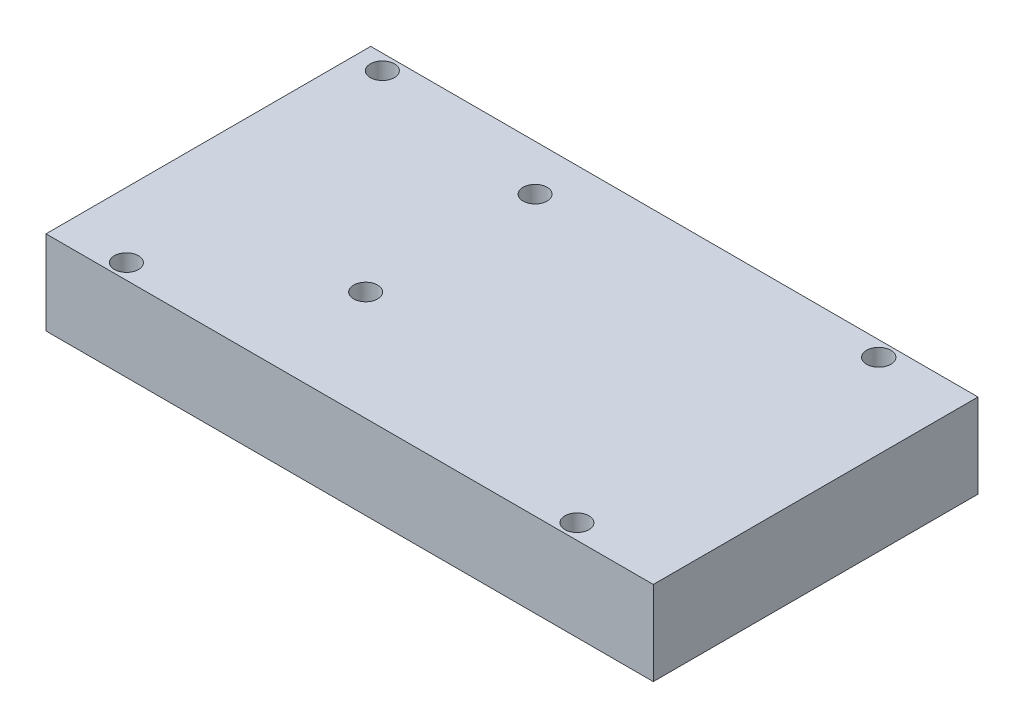
ISO-10303-21;
HEADER;
FILE_DESCRIPTION(('STEP AP214'),'2;1');
FILE_NAME('part.step','',(''),(''),'','','');
FILE_SCHEMA(('AUTOMOTIVE_DESIGN { 1 0 10303 214 1 1 1 1 }'));
ENDSEC;
DATA;
#1=APPLICATION_CONTEXT('core data for automotive mechanical design processes');
#2=APPLICATION_PROTOCOL_DEFINITION('international standard','automotive_design',2000,#1);
#3=PRODUCT_CONTEXT('',#1,'mechanical');
#4=PRODUCT('Part','Part','',(#3));
#5=PRODUCT_RELATED_PRODUCT_CATEGORY('part','',(#4));
#6=PRODUCT_DEFINITION_FORMATION('','',#4);
#7=PRODUCT_DEFINITION_CONTEXT('part definition',#1,'design');
#8=PRODUCT_DEFINITION('design','',#6,#7);
#9=PRODUCT_DEFINITION_SHAPE('','',#8);
#10=(LENGTH_UNIT() NAMED_UNIT(*) SI_UNIT(.MILLI.,.METRE.));
#11=(NAMED_UNIT(*) PLANE_ANGLE_UNIT() SI_UNIT($,.RADIAN.));
#12=(NAMED_UNIT(*) SI_UNIT($,.STERADIAN.) SOLID_ANGLE_UNIT());
#13=UNCERTAINTY_MEASURE_WITH_UNIT(LENGTH_MEASURE(1.E-05),#10,'distance_accuracy_value','');
#14=(GEOMETRIC_REPRESENTATION_CONTEXT(3) GLOBAL_UNCERTAINTY_ASSIGNED_CONTEXT((#13)) GLOBAL_UNIT_ASSIGNED_CONTEXT((#10,
#11,#12)) REPRESENTATION_CONTEXT('',''));
#15=CARTESIAN_POINT('',(0.,0.,0.));
#16=DIRECTION('',(0.,0.,1.));
#17=DIRECTION('',(1.,0.,0.));
#18=AXIS2_PLACEMENT_3D('',#15,#16,#17);
#19=CARTESIAN_POINT('',(50.5,14.,27.));
#20=DIRECTION('',(-1.,0.,0.));
#21=DIRECTION('',(0.,0.,1.));
#22=AXIS2_PLACEMENT_3D('',#19,#20,#21);
#23=PLANE('',#22);
#24=DIRECTION('',(0.,0.,-1.));
#25=VECTOR('',#24,1.);
#26=CARTESIAN_POINT('',(50.5,0.,27.));
#27=LINE('',#26,#25);
#28=CARTESIAN_POINT('',(50.5,0.,27.));
#29=VERTEX_POINT('',#28);
#30=CARTESIAN_POINT('',(50.5,0.,-27.));
#31=VERTEX_POINT('',#30);
#32=EDGE_CURVE('E116',#29,#31,#27,.T.);
#33=ORIENTED_EDGE('',*,*,#32,.T.);
#34=DIRECTION('',(0.,-1.,0.));
#35=VECTOR('',#34,1.);
#36=CARTESIAN_POINT('',(50.5,14.,-27.));
#37=LINE('',#36,#35);
#38=CARTESIAN_POINT('',(50.5,14.,-27.));
#39=VERTEX_POINT('',#38);
#40=EDGE_CURVE('E11',#39,#31,#37,.T.);
#41=ORIENTED_EDGE('',*,*,#40,.F.);
#42=DIRECTION('',(0.,0.,-1.));
#43=VECTOR('',#42,1.);
#44=CARTESIAN_POINT('',(50.5,14.,27.));
#45=LINE('',#44,#43);
#46=CARTESIAN_POINT('',(50.5,14.,27.));
#47=VERTEX_POINT('',#46);
#48=EDGE_CURVE('E99',#47,#39,#45,.T.);
#49=ORIENTED_EDGE('',*,*,#48,.F.);
#50=DIRECTION('',(0.,-1.,0.));
#51=VECTOR('',#50,1.);
#52=CARTESIAN_POINT('',(50.5,14.,27.));
#53=LINE('',#52,#51);
#54=EDGE_CURVE('E112',#47,#29,#53,.T.);
#55=ORIENTED_EDGE('',*,*,#54,.T.);
#56=EDGE_LOOP('',(#33,#41,#49,#55));
#57=FACE_BOUND('',#56,.T.);
#58=ADVANCED_FACE('F45',(#57),#23,.F.);
#59=CARTESIAN_POINT('',(-50.5,14.,-27.));
#60=DIRECTION('',(0.,0.,1.));
#61=DIRECTION('',(1.,0.,0.));
#62=AXIS2_PLACEMENT_3D('',#59,#60,#61);
#63=PLANE('',#62);
#64=DIRECTION('',(-1.,0.,0.));
#65=VECTOR('',#64,1.);
#66=CARTESIAN_POINT('',(-50.5,0.,-27.));
#67=LINE('',#66,#65);
#68=CARTESIAN_POINT('',(-50.5,0.,-27.));
#69=VERTEX_POINT('',#68);
#70=EDGE_CURVE('E104',#31,#69,#67,.T.);
#71=ORIENTED_EDGE('',*,*,#70,.T.);
#72=DIRECTION('',(0.,-1.,0.));
#73=VECTOR('',#72,1.);
#74=CARTESIAN_POINT('',(-50.5,14.,-27.));
#75=LINE('',#74,#73);
#76=CARTESIAN_POINT('',(-50.5,14.,-27.));
#77=VERTEX_POINT('',#76);
#78=EDGE_CURVE('E55',#77,#69,#75,.T.);
#79=ORIENTED_EDGE('',*,*,#78,.F.);
#80=DIRECTION('',(-1.,0.,0.));
#81=VECTOR('',#80,1.);
#82=CARTESIAN_POINT('',(-50.5,14.,-27.));
#83=LINE('',#82,#81);
#84=EDGE_CURVE('E94',#39,#77,#83,.T.);
#85=ORIENTED_EDGE('',*,*,#84,.F.);
#86=ORIENTED_EDGE('',*,*,#40,.T.);
#87=EDGE_LOOP('',(#71,#79,#85,#86));
#88=FACE_BOUND('',#87,.T.);
#89=ADVANCED_FACE('F103',(#88),#63,.F.);
#90=CARTESIAN_POINT('',(-50.5,14.,27.));
#91=DIRECTION('',(1.,0.,0.));
#92=DIRECTION('',(0.,0.,-1.));
#93=AXIS2_PLACEMENT_3D('',#90,#91,#92);
#94=PLANE('',#93);
#95=DIRECTION('',(0.,0.,1.));
#96=VECTOR('',#95,1.);
#97=CARTESIAN_POINT('',(-50.5,0.,27.));
#98=LINE('',#97,#96);
#99=CARTESIAN_POINT('',(-50.5,0.,27.));
#100=VERTEX_POINT('',#99);
#101=EDGE_CURVE('E81',#69,#100,#98,.T.);
#102=ORIENTED_EDGE('',*,*,#101,.T.);
#103=DIRECTION('',(0.,-1.,0.));
#104=VECTOR('',#103,1.);
#105=CARTESIAN_POINT('',(-50.5,14.,27.));
#106=LINE('',#105,#104);
#107=CARTESIAN_POINT('',(-50.5,14.,27.));
#108=VERTEX_POINT('',#107);
#109=EDGE_CURVE('E106',#108,#100,#106,.T.);
#110=ORIENTED_EDGE('',*,*,#109,.F.);
#111=DIRECTION('',(0.,0.,1.));
#112=VECTOR('',#111,1.);
#113=CARTESIAN_POINT('',(-50.5,14.,27.));
#114=LINE('',#113,#112);
#115=EDGE_CURVE('E97',#77,#108,#114,.T.);
#116=ORIENTED_EDGE('',*,*,#115,.F.);
#117=ORIENTED_EDGE('',*,*,#78,.T.);
#118=EDGE_LOOP('',(#102,#110,#116,#117));
#119=FACE_BOUND('',#118,.T.);
#120=ADVANCED_FACE('F108',(#119),#94,.F.);
#121=CARTESIAN_POINT('',(-50.5,14.,27.));
#122=DIRECTION('',(0.,0.,-1.));
#123=DIRECTION('',(-1.,0.,0.));
#124=AXIS2_PLACEMENT_3D('',#121,#122,#123);
#125=PLANE('',#124);
#126=DIRECTION('',(1.,0.,0.));
#127=VECTOR('',#126,1.);
#128=CARTESIAN_POINT('',(-50.5,0.,27.));
#129=LINE('',#128,#127);
#130=EDGE_CURVE('E87',#100,#29,#129,.T.);
#131=ORIENTED_EDGE('',*,*,#130,.T.);
#132=ORIENTED_EDGE('',*,*,#54,.F.);
#133=DIRECTION('',(1.,0.,0.));
#134=VECTOR('',#133,1.);
#135=CARTESIAN_POINT('',(-50.5,14.,27.));
#136=LINE('',#135,#134);
#137=EDGE_CURVE('E64',#108,#47,#136,.T.);
#138=ORIENTED_EDGE('',*,*,#137,.F.);
#139=ORIENTED_EDGE('',*,*,#109,.T.);
#140=EDGE_LOOP('',(#131,#132,#138,#139));
#141=FACE_BOUND('',#140,.T.);
#142=ADVANCED_FACE('F174',(#141),#125,.F.);
#143=CARTESIAN_POINT('',(0.,14.,0.));
#144=DIRECTION('',(0.,-1.,0.));
#145=DIRECTION('',(0.,0.,-1.));
#146=AXIS2_PLACEMENT_3D('',#143,#144,#145);
#147=PLANE('',#146);
#148=CARTESIAN_POINT('',(-46.02,14.,-24.46));
#149=DIRECTION('',(0.,1.,0.));
#150=DIRECTION('',(0.,0.,1.));
#151=AXIS2_PLACEMENT_3D('',#148,#149,#150);
#152=CIRCLE('',#151,2.);
#153=CARTESIAN_POINT('',(-46.02,14.,-22.46));
#154=VERTEX_POINT('',#153);
#155=EDGE_CURVE('E135',#154,#154,#152,.T.);
#156=ORIENTED_EDGE('',*,*,#155,.F.);
#157=EDGE_LOOP('',(#156));
#158=FACE_BOUND('',#157,.T.);
#159=CARTESIAN_POINT('',(-15.54,14.,-19.38));
#160=DIRECTION('',(0.,1.,0.));
#161=DIRECTION('',(0.,0.,1.));
#162=AXIS2_PLACEMENT_3D('',#159,#160,#161);
#163=CIRCLE('',#162,2.);
#164=CARTESIAN_POINT('',(-15.54,14.,-17.38));
#165=VERTEX_POINT('',#164);
#166=EDGE_CURVE('E274',#165,#165,#163,.T.);
#167=ORIENTED_EDGE('',*,*,#166,.F.);
#168=EDGE_LOOP('',(#167));
#169=FACE_BOUND('',#168,.T.);
#170=CARTESIAN_POINT('',(-39.67,14.,24.46));
#171=DIRECTION('',(0.,1.,0.));
#172=DIRECTION('',(0.,0.,1.));
#173=AXIS2_PLACEMENT_3D('',#170,#171,#172);
#174=CIRCLE('',#173,2.);
#175=CARTESIAN_POINT('',(-39.67,14.,26.46));
#176=VERTEX_POINT('',#175);
#177=EDGE_CURVE('E289',#176,#176,#174,.T.);
#178=ORIENTED_EDGE('',*,*,#177,.F.);
#179=EDGE_LOOP('',(#178));
#180=FACE_BOUND('',#179,.T.);
#181=CARTESIAN_POINT('',(36.53,14.,-24.46));
#182=DIRECTION('',(0.,1.,0.));
#183=DIRECTION('',(0.,0.,1.));
#184=AXIS2_PLACEMENT_3D('',#181,#182,#183);
#185=CIRCLE('',#184,2.02327688758629);
#186=CARTESIAN_POINT('',(36.53,14.,-22.4367231124137));
#187=VERTEX_POINT('',#186);
#188=EDGE_CURVE('E287',#187,#187,#185,.T.);
#189=ORIENTED_EDGE('',*,*,#188,.F.);
#190=EDGE_LOOP('',(#189));
#191=FACE_BOUND('',#190,.T.);
#192=CARTESIAN_POINT('',(-15.54,14.,8.79890287068528));
#193=DIRECTION('',(0.,1.,0.));
#194=DIRECTION('',(0.,0.,1.));
#195=AXIS2_PLACEMENT_3D('',#192,#193,#194);
#196=CIRCLE('',#195,2.);
#197=CARTESIAN_POINT('',(-15.54,14.,10.7989028706853));
#198=VERTEX_POINT('',#197);
#199=EDGE_CURVE('E281',#198,#198,#196,.T.);
#200=ORIENTED_EDGE('',*,*,#199,.F.);
#201=EDGE_LOOP('',(#200));
#202=FACE_BOUND('',#201,.T.);
#203=CARTESIAN_POINT('',(35.26,14.,24.46));
#204=DIRECTION('',(0.,1.,0.));
#205=DIRECTION('',(0.,0.,1.));
#206=AXIS2_PLACEMENT_3D('',#203,#204,#205);
#207=CIRCLE('',#206,2.);
#208=CARTESIAN_POINT('',(35.26,14.,26.46));
#209=VERTEX_POINT('',#208);
#210=EDGE_CURVE('E277',#209,#209,#207,.T.);
#211=ORIENTED_EDGE('',*,*,#210,.F.);
#212=EDGE_LOOP('',(#211));
#213=FACE_BOUND('',#212,.T.);
#214=ORIENTED_EDGE('',*,*,#48,.T.);
#215=ORIENTED_EDGE('',*,*,#84,.T.);
#216=ORIENTED_EDGE('',*,*,#115,.T.);
#217=ORIENTED_EDGE('',*,*,#137,.T.);
#218=EDGE_LOOP('',(#214,#215,#216,#217));
#219=FACE_BOUND('',#218,.T.);
#220=ADVANCED_FACE('F95',(#158,#169,#180,#191,#202,#213,#219),#147,.F.);
#221=CARTESIAN_POINT('',(0.,0.,0.));
#222=DIRECTION('',(0.,-1.,0.));
#223=DIRECTION('',(0.,0.,-1.));
#224=AXIS2_PLACEMENT_3D('',#221,#222,#223);
#225=PLANE('',#224);
#226=CARTESIAN_POINT('',(-46.02,0.,-24.46));
#227=DIRECTION('',(0.,-1.,0.));
#228=DIRECTION('',(0.,0.,-1.));
#229=AXIS2_PLACEMENT_3D('',#226,#227,#228);
#230=CIRCLE('',#229,2.);
#231=CARTESIAN_POINT('',(-46.02,0.,-26.46));
#232=VERTEX_POINT('',#231);
#233=EDGE_CURVE('E48',#232,#232,#230,.T.);
#234=ORIENTED_EDGE('',*,*,#233,.F.);
#235=EDGE_LOOP('',(#234));
#236=FACE_BOUND('',#235,.T.);
#237=CARTESIAN_POINT('',(-15.54,0.,-19.38));
#238=DIRECTION('',(0.,-1.,0.));
#239=DIRECTION('',(0.,0.,-1.));
#240=AXIS2_PLACEMENT_3D('',#237,#238,#239);
#241=CIRCLE('',#240,2.);
#242=CARTESIAN_POINT('',(-15.54,0.,-21.38));
#243=VERTEX_POINT('',#242);
#244=EDGE_CURVE('E146',#243,#243,#241,.T.);
#245=ORIENTED_EDGE('',*,*,#244,.F.);
#246=EDGE_LOOP('',(#245));
#247=FACE_BOUND('',#246,.T.);
#248=CARTESIAN_POINT('',(-39.67,0.,24.46));
#249=DIRECTION('',(0.,-1.,0.));
#250=DIRECTION('',(0.,0.,-1.));
#251=AXIS2_PLACEMENT_3D('',#248,#249,#250);
#252=CIRCLE('',#251,2.);
#253=CARTESIAN_POINT('',(-39.67,0.,22.46));
#254=VERTEX_POINT('',#253);
#255=EDGE_CURVE('E143',#254,#254,#252,.T.);
#256=ORIENTED_EDGE('',*,*,#255,.F.);
#257=EDGE_LOOP('',(#256));
#258=FACE_BOUND('',#257,.T.);
#259=CARTESIAN_POINT('',(36.53,0.,-24.46));
#260=DIRECTION('',(0.,-1.,0.));
#261=DIRECTION('',(0.,0.,-1.));
#262=AXIS2_PLACEMENT_3D('',#259,#260,#261);
#263=CIRCLE('',#262,2.02327688758629);
#264=CARTESIAN_POINT('',(36.53,0.,-26.4832768875863));
#265=VERTEX_POINT('',#264);
#266=EDGE_CURVE('E139',#265,#265,#263,.T.);
#267=ORIENTED_EDGE('',*,*,#266,.F.);
#268=EDGE_LOOP('',(#267));
#269=FACE_BOUND('',#268,.T.);
#270=CARTESIAN_POINT('',(-15.54,0.,8.79890287068528));
#271=DIRECTION('',(0.,-1.,0.));
#272=DIRECTION('',(0.,0.,-1.));
#273=AXIS2_PLACEMENT_3D('',#270,#271,#272);
#274=CIRCLE('',#273,2.);
#275=CARTESIAN_POINT('',(-15.54,0.,6.79890287068528));
#276=VERTEX_POINT('',#275);
#277=EDGE_CURVE('E134',#276,#276,#274,.T.);
#278=ORIENTED_EDGE('',*,*,#277,.F.);
#279=EDGE_LOOP('',(#278));
#280=FACE_BOUND('',#279,.T.);
#281=CARTESIAN_POINT('',(35.26,0.,24.46));
#282=DIRECTION('',(0.,-1.,0.));
#283=DIRECTION('',(0.,0.,-1.));
#284=AXIS2_PLACEMENT_3D('',#281,#282,#283);
#285=CIRCLE('',#284,2.);
#286=CARTESIAN_POINT('',(35.26,0.,22.46));
#287=VERTEX_POINT('',#286);
#288=EDGE_CURVE('E130',#287,#287,#285,.T.);
#289=ORIENTED_EDGE('',*,*,#288,.F.);
#290=EDGE_LOOP('',(#289));
#291=FACE_BOUND('',#290,.T.);
#292=ORIENTED_EDGE('',*,*,#32,.F.);
#293=ORIENTED_EDGE('',*,*,#130,.F.);
#294=ORIENTED_EDGE('',*,*,#101,.F.);
#295=ORIENTED_EDGE('',*,*,#70,.F.);
#296=EDGE_LOOP('',(#292,#293,#294,#295));
#297=FACE_BOUND('',#296,.T.);
#298=ADVANCED_FACE('F158',(#236,#247,#258,#269,#280,#291,#297),#225,.T.);
#299=CARTESIAN_POINT('',(35.26,-86.,24.46));
#300=DIRECTION('',(0.,1.,0.));
#301=DIRECTION('',(0.,0.,1.));
#302=AXIS2_PLACEMENT_3D('',#299,#300,#301);
#303=CYLINDRICAL_SURFACE('',#302,2.);
#304=ORIENTED_EDGE('',*,*,#288,.T.);
#305=EDGE_LOOP('',(#304));
#306=FACE_BOUND('',#305,.T.);
#307=ORIENTED_EDGE('',*,*,#210,.T.);
#308=EDGE_LOOP('',(#307));
#309=FACE_BOUND('',#308,.T.);
#310=ADVANCED_FACE('F161',(#306,#309),#303,.F.);
#311=CARTESIAN_POINT('',(-15.54,-86.,8.79890287068528));
#312=DIRECTION('',(0.,1.,0.));
#313=DIRECTION('',(0.,0.,1.));
#314=AXIS2_PLACEMENT_3D('',#311,#312,#313);
#315=CYLINDRICAL_SURFACE('',#314,2.);
#316=ORIENTED_EDGE('',*,*,#277,.T.);
#317=EDGE_LOOP('',(#316));
#318=FACE_BOUND('',#317,.T.);
#319=ORIENTED_EDGE('',*,*,#199,.T.);
#320=EDGE_LOOP('',(#319));
#321=FACE_BOUND('',#320,.T.);
#322=ADVANCED_FACE('F221',(#318,#321),#315,.F.);
#323=CARTESIAN_POINT('',(36.53,-86.,-24.46));
#324=DIRECTION('',(0.,1.,0.));
#325=DIRECTION('',(0.,0.,1.));
#326=AXIS2_PLACEMENT_3D('',#323,#324,#325);
#327=CYLINDRICAL_SURFACE('',#326,2.02327688758629);
#328=ORIENTED_EDGE('',*,*,#266,.T.);
#329=EDGE_LOOP('',(#328));
#330=FACE_BOUND('',#329,.T.);
#331=ORIENTED_EDGE('',*,*,#188,.T.);
#332=EDGE_LOOP('',(#331));
#333=FACE_BOUND('',#332,.T.);
#334=ADVANCED_FACE('F231',(#330,#333),#327,.F.);
#335=CARTESIAN_POINT('',(-39.67,-86.,24.46));
#336=DIRECTION('',(0.,1.,0.));
#337=DIRECTION('',(0.,0.,1.));
#338=AXIS2_PLACEMENT_3D('',#335,#336,#337);
#339=CYLINDRICAL_SURFACE('',#338,2.);
#340=ORIENTED_EDGE('',*,*,#255,.T.);
#341=EDGE_LOOP('',(#340));
#342=FACE_BOUND('',#341,.T.);
#343=ORIENTED_EDGE('',*,*,#177,.T.);
#344=EDGE_LOOP('',(#343));
#345=FACE_BOUND('',#344,.T.);
#346=ADVANCED_FACE('F241',(#342,#345),#339,.F.);
#347=CARTESIAN_POINT('',(-15.54,-86.,-19.38));
#348=DIRECTION('',(0.,1.,0.));
#349=DIRECTION('',(0.,0.,1.));
#350=AXIS2_PLACEMENT_3D('',#347,#348,#349);
#351=CYLINDRICAL_SURFACE('',#350,2.);
#352=ORIENTED_EDGE('',*,*,#244,.T.);
#353=EDGE_LOOP('',(#352));
#354=FACE_BOUND('',#353,.T.);
#355=ORIENTED_EDGE('',*,*,#166,.T.);
#356=EDGE_LOOP('',(#355));
#357=FACE_BOUND('',#356,.T.);
#358=ADVANCED_FACE('F251',(#354,#357),#351,.F.);
#359=CARTESIAN_POINT('',(-46.02,-86.,-24.46));
#360=DIRECTION('',(0.,1.,0.));
#361=DIRECTION('',(0.,0.,1.));
#362=AXIS2_PLACEMENT_3D('',#359,#360,#361);
#363=CYLINDRICAL_SURFACE('',#362,2.);
#364=ORIENTED_EDGE('',*,*,#233,.T.);
#365=EDGE_LOOP('',(#364));
#366=FACE_BOUND('',#365,.T.);
#367=ORIENTED_EDGE('',*,*,#155,.T.);
#368=EDGE_LOOP('',(#367));
#369=FACE_BOUND('',#368,.T.);
#370=ADVANCED_FACE('F155',(#366,#369),#363,.F.);
#371=CLOSED_SHELL('',(#58,#89,#120,#142,#220,#298,#310,#322,#334,#346,#358,#370));
#372=MANIFOLD_SOLID_BREP('B2',#371);
#373=ADVANCED_BREP_SHAPE_REPRESENTATION('',(#18,#372),#14);
#374=SHAPE_DEFINITION_REPRESENTATION(#9,#373);
ENDSEC;
END-ISO-10303-21;
